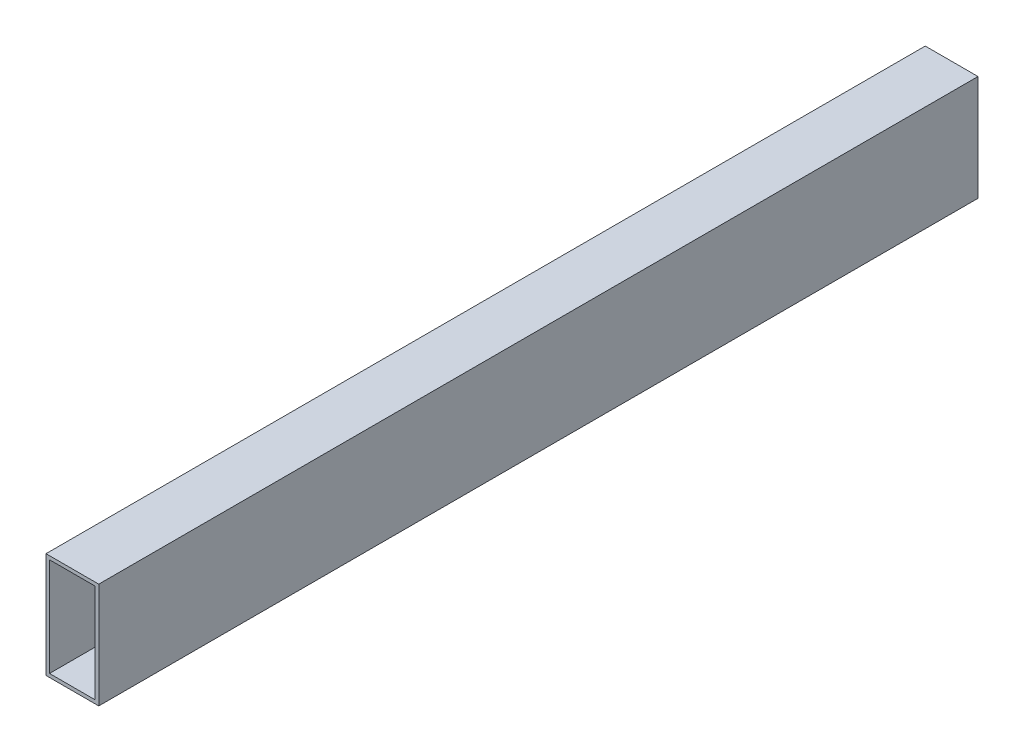
ISO-10303-21;
HEADER;
FILE_DESCRIPTION(('STEP AP214'),'2;1');
FILE_NAME('part.step','',(''),(''),'','','');
FILE_SCHEMA(('AUTOMOTIVE_DESIGN { 1 0 10303 214 1 1 1 1 }'));
ENDSEC;
DATA;
#1=APPLICATION_CONTEXT('core data for automotive mechanical design processes');
#2=APPLICATION_PROTOCOL_DEFINITION('international standard','automotive_design',2000,#1);
#3=PRODUCT_CONTEXT('',#1,'mechanical');
#4=PRODUCT('Part','Part','',(#3));
#5=PRODUCT_RELATED_PRODUCT_CATEGORY('part','',(#4));
#6=PRODUCT_DEFINITION_FORMATION('','',#4);
#7=PRODUCT_DEFINITION_CONTEXT('part definition',#1,'design');
#8=PRODUCT_DEFINITION('design','',#6,#7);
#9=PRODUCT_DEFINITION_SHAPE('','',#8);
#10=(LENGTH_UNIT() NAMED_UNIT(*) SI_UNIT(.MILLI.,.METRE.));
#11=(NAMED_UNIT(*) PLANE_ANGLE_UNIT() SI_UNIT($,.RADIAN.));
#12=(NAMED_UNIT(*) SI_UNIT($,.STERADIAN.) SOLID_ANGLE_UNIT());
#13=UNCERTAINTY_MEASURE_WITH_UNIT(LENGTH_MEASURE(1.E-05),#10,'distance_accuracy_value','');
#14=(GEOMETRIC_REPRESENTATION_CONTEXT(3) GLOBAL_UNCERTAINTY_ASSIGNED_CONTEXT((#13)) GLOBAL_UNIT_ASSIGNED_CONTEXT((#10,
#11,#12)) REPRESENTATION_CONTEXT('',''));
#15=CARTESIAN_POINT('',(0.,0.,0.));
#16=DIRECTION('',(0.,0.,1.));
#17=DIRECTION('',(1.,0.,0.));
#18=AXIS2_PLACEMENT_3D('',#15,#16,#17);
#19=CARTESIAN_POINT('',(-30.,60.,500.));
#20=DIRECTION('',(1.,0.,0.));
#21=DIRECTION('',(0.,0.,-1.));
#22=AXIS2_PLACEMENT_3D('',#19,#20,#21);
#23=PLANE('',#22);
#24=DIRECTION('',(0.,0.,-1.));
#25=VECTOR('',#24,1.);
#26=CARTESIAN_POINT('',(-30.,-60.,500.));
#27=LINE('',#26,#25);
#28=CARTESIAN_POINT('',(-30.,-60.,500.));
#29=VERTEX_POINT('',#28);
#30=CARTESIAN_POINT('',(-30.,-60.,-500.));
#31=VERTEX_POINT('',#30);
#32=EDGE_CURVE('E96',#29,#31,#27,.T.);
#33=ORIENTED_EDGE('',*,*,#32,.F.);
#34=DIRECTION('',(0.,-1.,0.));
#35=VECTOR('',#34,1.);
#36=CARTESIAN_POINT('',(-30.,60.,500.));
#37=LINE('',#36,#35);
#38=CARTESIAN_POINT('',(-30.,60.,500.));
#39=VERTEX_POINT('',#38);
#40=EDGE_CURVE('E85',#39,#29,#37,.T.);
#41=ORIENTED_EDGE('',*,*,#40,.F.);
#42=DIRECTION('',(0.,0.,-1.));
#43=VECTOR('',#42,1.);
#44=CARTESIAN_POINT('',(-30.,60.,500.));
#45=LINE('',#44,#43);
#46=CARTESIAN_POINT('',(-30.,60.,-500.));
#47=VERTEX_POINT('',#46);
#48=EDGE_CURVE('E101',#39,#47,#45,.T.);
#49=ORIENTED_EDGE('',*,*,#48,.T.);
#50=DIRECTION('',(0.,-1.,0.));
#51=VECTOR('',#50,1.);
#52=CARTESIAN_POINT('',(-30.,60.,-500.));
#53=LINE('',#52,#51);
#54=EDGE_CURVE('E97',#47,#31,#53,.T.);
#55=ORIENTED_EDGE('',*,*,#54,.T.);
#56=EDGE_LOOP('',(#33,#41,#49,#55));
#57=FACE_BOUND('',#56,.T.);
#58=ADVANCED_FACE('F33',(#57),#23,.F.);
#59=CARTESIAN_POINT('',(-30.,-60.,500.));
#60=DIRECTION('',(0.,1.,0.));
#61=DIRECTION('',(-1.,0.,0.));
#62=AXIS2_PLACEMENT_3D('',#59,#60,#61);
#63=PLANE('',#62);
#64=DIRECTION('',(0.,0.,-1.));
#65=VECTOR('',#64,1.);
#66=CARTESIAN_POINT('',(30.,-60.,500.));
#67=LINE('',#66,#65);
#68=CARTESIAN_POINT('',(30.,-60.,500.));
#69=VERTEX_POINT('',#68);
#70=CARTESIAN_POINT('',(30.,-60.,-500.));
#71=VERTEX_POINT('',#70);
#72=EDGE_CURVE('E100',#69,#71,#67,.T.);
#73=ORIENTED_EDGE('',*,*,#72,.F.);
#74=DIRECTION('',(1.,0.,0.));
#75=VECTOR('',#74,1.);
#76=CARTESIAN_POINT('',(-30.,-60.,500.));
#77=LINE('',#76,#75);
#78=EDGE_CURVE('E82',#29,#69,#77,.T.);
#79=ORIENTED_EDGE('',*,*,#78,.F.);
#80=ORIENTED_EDGE('',*,*,#32,.T.);
#81=DIRECTION('',(1.,0.,0.));
#82=VECTOR('',#81,1.);
#83=CARTESIAN_POINT('',(-30.,-60.,-500.));
#84=LINE('',#83,#82);
#85=EDGE_CURVE('E123',#31,#71,#84,.T.);
#86=ORIENTED_EDGE('',*,*,#85,.T.);
#87=EDGE_LOOP('',(#73,#79,#80,#86));
#88=FACE_BOUND('',#87,.T.);
#89=ADVANCED_FACE('F103',(#88),#63,.F.);
#90=CARTESIAN_POINT('',(30.,60.,500.));
#91=DIRECTION('',(-1.,0.,0.));
#92=DIRECTION('',(0.,-1.,0.));
#93=AXIS2_PLACEMENT_3D('',#90,#91,#92);
#94=PLANE('',#93);
#95=DIRECTION('',(0.,0.,-1.));
#96=VECTOR('',#95,1.);
#97=CARTESIAN_POINT('',(30.,60.,500.));
#98=LINE('',#97,#96);
#99=CARTESIAN_POINT('',(30.,60.,500.));
#100=VERTEX_POINT('',#99);
#101=CARTESIAN_POINT('',(30.,60.,-500.));
#102=VERTEX_POINT('',#101);
#103=EDGE_CURVE('E37',#100,#102,#98,.T.);
#104=ORIENTED_EDGE('',*,*,#103,.F.);
#105=DIRECTION('',(0.,1.,0.));
#106=VECTOR('',#105,1.);
#107=CARTESIAN_POINT('',(30.,60.,500.));
#108=LINE('',#107,#106);
#109=EDGE_CURVE('E106',#69,#100,#108,.T.);
#110=ORIENTED_EDGE('',*,*,#109,.F.);
#111=ORIENTED_EDGE('',*,*,#72,.T.);
#112=DIRECTION('',(0.,1.,0.));
#113=VECTOR('',#112,1.);
#114=CARTESIAN_POINT('',(30.,60.,-500.));
#115=LINE('',#114,#113);
#116=EDGE_CURVE('E110',#71,#102,#115,.T.);
#117=ORIENTED_EDGE('',*,*,#116,.T.);
#118=EDGE_LOOP('',(#104,#110,#111,#117));
#119=FACE_BOUND('',#118,.T.);
#120=ADVANCED_FACE('F121',(#119),#94,.F.);
#121=CARTESIAN_POINT('',(-30.,60.,500.));
#122=DIRECTION('',(0.,-1.,0.));
#123=DIRECTION('',(1.,0.,0.));
#124=AXIS2_PLACEMENT_3D('',#121,#122,#123);
#125=PLANE('',#124);
#126=DIRECTION('',(-1.,0.,0.));
#127=VECTOR('',#126,1.);
#128=CARTESIAN_POINT('',(-30.,60.,-500.));
#129=LINE('',#128,#127);
#130=EDGE_CURVE('E120',#102,#47,#129,.T.);
#131=ORIENTED_EDGE('',*,*,#130,.T.);
#132=ORIENTED_EDGE('',*,*,#48,.F.);
#133=DIRECTION('',(-1.,0.,0.));
#134=VECTOR('',#133,1.);
#135=CARTESIAN_POINT('',(-30.,60.,500.));
#136=LINE('',#135,#134);
#137=EDGE_CURVE('E89',#100,#39,#136,.T.);
#138=ORIENTED_EDGE('',*,*,#137,.F.);
#139=ORIENTED_EDGE('',*,*,#103,.T.);
#140=EDGE_LOOP('',(#131,#132,#138,#139));
#141=FACE_BOUND('',#140,.T.);
#142=ADVANCED_FACE('F35',(#141),#125,.F.);
#143=CARTESIAN_POINT('',(0.,0.,500.));
#144=DIRECTION('',(0.,0.,1.));
#145=DIRECTION('',(1.,0.,0.));
#146=AXIS2_PLACEMENT_3D('',#143,#144,#145);
#147=PLANE('',#146);
#148=DIRECTION('',(0.,-1.,0.));
#149=VECTOR('',#148,1.);
#150=CARTESIAN_POINT('',(-26.,56.,500.));
#151=LINE('',#150,#149);
#152=CARTESIAN_POINT('',(-26.,-56.,500.));
#153=VERTEX_POINT('',#152);
#154=CARTESIAN_POINT('',(-26.,56.,500.));
#155=VERTEX_POINT('',#154);
#156=EDGE_CURVE('E128',#153,#155,#151,.F.);
#157=ORIENTED_EDGE('',*,*,#156,.T.);
#158=DIRECTION('',(-1.,0.,0.));
#159=VECTOR('',#158,1.);
#160=CARTESIAN_POINT('',(-26.,56.,500.));
#161=LINE('',#160,#159);
#162=CARTESIAN_POINT('',(26.,56.,500.));
#163=VERTEX_POINT('',#162);
#164=EDGE_CURVE('E124',#155,#163,#161,.F.);
#165=ORIENTED_EDGE('',*,*,#164,.T.);
#166=DIRECTION('',(0.,1.,0.));
#167=VECTOR('',#166,1.);
#168=CARTESIAN_POINT('',(26.,56.,500.));
#169=LINE('',#168,#167);
#170=CARTESIAN_POINT('',(26.,-56.,500.));
#171=VERTEX_POINT('',#170);
#172=EDGE_CURVE('E142',#163,#171,#169,.F.);
#173=ORIENTED_EDGE('',*,*,#172,.T.);
#174=DIRECTION('',(1.,0.,0.));
#175=VECTOR('',#174,1.);
#176=CARTESIAN_POINT('',(-26.,-56.,500.));
#177=LINE('',#176,#175);
#178=EDGE_CURVE('E132',#171,#153,#177,.F.);
#179=ORIENTED_EDGE('',*,*,#178,.T.);
#180=EDGE_LOOP('',(#157,#165,#173,#179));
#181=FACE_BOUND('',#180,.T.);
#182=ORIENTED_EDGE('',*,*,#40,.T.);
#183=ORIENTED_EDGE('',*,*,#78,.T.);
#184=ORIENTED_EDGE('',*,*,#109,.T.);
#185=ORIENTED_EDGE('',*,*,#137,.T.);
#186=EDGE_LOOP('',(#182,#183,#184,#185));
#187=FACE_BOUND('',#186,.T.);
#188=ADVANCED_FACE('F87',(#181,#187),#147,.T.);
#189=CARTESIAN_POINT('',(0.,0.,-500.));
#190=DIRECTION('',(0.,0.,1.));
#191=DIRECTION('',(1.,0.,0.));
#192=AXIS2_PLACEMENT_3D('',#189,#190,#191);
#193=PLANE('',#192);
#194=DIRECTION('',(0.,-1.,0.));
#195=VECTOR('',#194,1.);
#196=CARTESIAN_POINT('',(-26.,56.,-500.));
#197=LINE('',#196,#195);
#198=CARTESIAN_POINT('',(-26.,-56.,-500.));
#199=VERTEX_POINT('',#198);
#200=CARTESIAN_POINT('',(-26.,56.,-500.));
#201=VERTEX_POINT('',#200);
#202=EDGE_CURVE('E11',#199,#201,#197,.F.);
#203=ORIENTED_EDGE('',*,*,#202,.F.);
#204=DIRECTION('',(1.,0.,0.));
#205=VECTOR('',#204,1.);
#206=CARTESIAN_POINT('',(-26.,-56.,-500.));
#207=LINE('',#206,#205);
#208=CARTESIAN_POINT('',(26.,-56.,-500.));
#209=VERTEX_POINT('',#208);
#210=EDGE_CURVE('E43',#209,#199,#207,.F.);
#211=ORIENTED_EDGE('',*,*,#210,.F.);
#212=DIRECTION('',(0.,1.,0.));
#213=VECTOR('',#212,1.);
#214=CARTESIAN_POINT('',(26.,56.,-500.));
#215=LINE('',#214,#213);
#216=CARTESIAN_POINT('',(26.,56.,-500.));
#217=VERTEX_POINT('',#216);
#218=EDGE_CURVE('E139',#217,#209,#215,.F.);
#219=ORIENTED_EDGE('',*,*,#218,.F.);
#220=DIRECTION('',(-1.,0.,0.));
#221=VECTOR('',#220,1.);
#222=CARTESIAN_POINT('',(-26.,56.,-500.));
#223=LINE('',#222,#221);
#224=EDGE_CURVE('E136',#201,#217,#223,.F.);
#225=ORIENTED_EDGE('',*,*,#224,.F.);
#226=EDGE_LOOP('',(#203,#211,#219,#225));
#227=FACE_BOUND('',#226,.T.);
#228=ORIENTED_EDGE('',*,*,#54,.F.);
#229=ORIENTED_EDGE('',*,*,#130,.F.);
#230=ORIENTED_EDGE('',*,*,#116,.F.);
#231=ORIENTED_EDGE('',*,*,#85,.F.);
#232=EDGE_LOOP('',(#228,#229,#230,#231));
#233=FACE_BOUND('',#232,.T.);
#234=ADVANCED_FACE('F189',(#227,#233),#193,.F.);
#235=CARTESIAN_POINT('',(-26.,56.,500.));
#236=DIRECTION('',(0.,1.,0.));
#237=DIRECTION('',(-1.,0.,0.));
#238=AXIS2_PLACEMENT_3D('',#235,#236,#237);
#239=PLANE('',#238);
#240=DIRECTION('',(0.,0.,-1.));
#241=VECTOR('',#240,1.);
#242=CARTESIAN_POINT('',(26.,56.,500.));
#243=LINE('',#242,#241);
#244=EDGE_CURVE('E144',#163,#217,#243,.T.);
#245=ORIENTED_EDGE('',*,*,#244,.F.);
#246=ORIENTED_EDGE('',*,*,#164,.F.);
#247=DIRECTION('',(0.,0.,-1.));
#248=VECTOR('',#247,1.);
#249=CARTESIAN_POINT('',(-26.,56.,500.));
#250=LINE('',#249,#248);
#251=EDGE_CURVE('E131',#155,#201,#250,.T.);
#252=ORIENTED_EDGE('',*,*,#251,.T.);
#253=ORIENTED_EDGE('',*,*,#224,.T.);
#254=EDGE_LOOP('',(#245,#246,#252,#253));
#255=FACE_BOUND('',#254,.T.);
#256=ADVANCED_FACE('F166',(#255),#239,.F.);
#257=CARTESIAN_POINT('',(26.,56.,500.));
#258=DIRECTION('',(1.,0.,0.));
#259=DIRECTION('',(0.,0.,-1.));
#260=AXIS2_PLACEMENT_3D('',#257,#258,#259);
#261=PLANE('',#260);
#262=DIRECTION('',(0.,0.,-1.));
#263=VECTOR('',#262,1.);
#264=CARTESIAN_POINT('',(26.,-56.,500.));
#265=LINE('',#264,#263);
#266=EDGE_CURVE('E137',#171,#209,#265,.T.);
#267=ORIENTED_EDGE('',*,*,#266,.F.);
#268=ORIENTED_EDGE('',*,*,#172,.F.);
#269=ORIENTED_EDGE('',*,*,#244,.T.);
#270=ORIENTED_EDGE('',*,*,#218,.T.);
#271=EDGE_LOOP('',(#267,#268,#269,#270));
#272=FACE_BOUND('',#271,.T.);
#273=ADVANCED_FACE('F170',(#272),#261,.F.);
#274=CARTESIAN_POINT('',(-26.,-56.,500.));
#275=DIRECTION('',(0.,-1.,0.));
#276=DIRECTION('',(1.,0.,0.));
#277=AXIS2_PLACEMENT_3D('',#274,#275,#276);
#278=PLANE('',#277);
#279=DIRECTION('',(0.,0.,-1.));
#280=VECTOR('',#279,1.);
#281=CARTESIAN_POINT('',(-26.,-56.,500.));
#282=LINE('',#281,#280);
#283=EDGE_CURVE('E133',#153,#199,#282,.T.);
#284=ORIENTED_EDGE('',*,*,#283,.F.);
#285=ORIENTED_EDGE('',*,*,#178,.F.);
#286=ORIENTED_EDGE('',*,*,#266,.T.);
#287=ORIENTED_EDGE('',*,*,#210,.T.);
#288=EDGE_LOOP('',(#284,#285,#286,#287));
#289=FACE_BOUND('',#288,.T.);
#290=ADVANCED_FACE('F178',(#289),#278,.F.);
#291=CARTESIAN_POINT('',(-26.,56.,500.));
#292=DIRECTION('',(-1.,0.,0.));
#293=DIRECTION('',(0.,0.,1.));
#294=AXIS2_PLACEMENT_3D('',#291,#292,#293);
#295=PLANE('',#294);
#296=ORIENTED_EDGE('',*,*,#202,.T.);
#297=ORIENTED_EDGE('',*,*,#251,.F.);
#298=ORIENTED_EDGE('',*,*,#156,.F.);
#299=ORIENTED_EDGE('',*,*,#283,.T.);
#300=EDGE_LOOP('',(#296,#297,#298,#299));
#301=FACE_BOUND('',#300,.T.);
#302=ADVANCED_FACE('F177',(#301),#295,.F.);
#303=CLOSED_SHELL('',(#58,#89,#120,#142,#188,#234,#256,#273,#290,#302));
#304=MANIFOLD_SOLID_BREP('B2',#303);
#305=ADVANCED_BREP_SHAPE_REPRESENTATION('',(#18,#304),#14);
#306=SHAPE_DEFINITION_REPRESENTATION(#9,#305);
ENDSEC;
END-ISO-10303-21;
